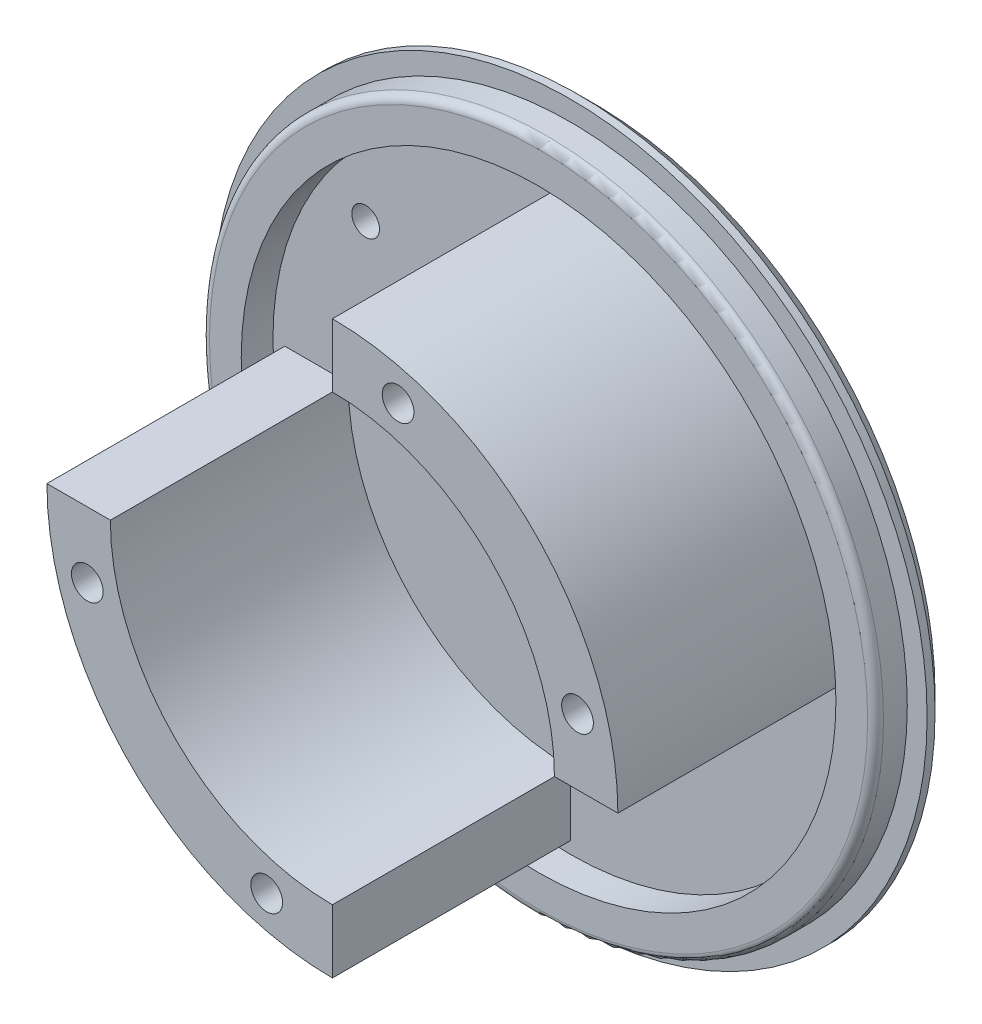
ISO-10303-21;
HEADER;
FILE_DESCRIPTION(('STEP AP214'),'2;1');
FILE_NAME('part.step','',(''),(''),'','','');
FILE_SCHEMA(('AUTOMOTIVE_DESIGN { 1 0 10303 214 1 1 1 1 }'));
ENDSEC;
DATA;
#1=APPLICATION_CONTEXT('core data for automotive mechanical design processes');
#2=APPLICATION_PROTOCOL_DEFINITION('international standard','automotive_design',2000,#1);
#3=PRODUCT_CONTEXT('',#1,'mechanical');
#4=PRODUCT('Part','Part','',(#3));
#5=PRODUCT_RELATED_PRODUCT_CATEGORY('part','',(#4));
#6=PRODUCT_DEFINITION_FORMATION('','',#4);
#7=PRODUCT_DEFINITION_CONTEXT('part definition',#1,'design');
#8=PRODUCT_DEFINITION('design','',#6,#7);
#9=PRODUCT_DEFINITION_SHAPE('','',#8);
#10=(LENGTH_UNIT() NAMED_UNIT(*) SI_UNIT(.MILLI.,.METRE.));
#11=(NAMED_UNIT(*) PLANE_ANGLE_UNIT() SI_UNIT($,.RADIAN.));
#12=(NAMED_UNIT(*) SI_UNIT($,.STERADIAN.) SOLID_ANGLE_UNIT());
#13=UNCERTAINTY_MEASURE_WITH_UNIT(LENGTH_MEASURE(1.E-05),#10,'distance_accuracy_value','');
#14=(GEOMETRIC_REPRESENTATION_CONTEXT(3) GLOBAL_UNCERTAINTY_ASSIGNED_CONTEXT((#13)) GLOBAL_UNIT_ASSIGNED_CONTEXT((#10,
#11,#12)) REPRESENTATION_CONTEXT('',''));
#15=CARTESIAN_POINT('',(0.,0.,0.));
#16=DIRECTION('',(0.,0.,1.));
#17=DIRECTION('',(1.,0.,0.));
#18=AXIS2_PLACEMENT_3D('',#15,#16,#17);
#19=CARTESIAN_POINT('',(0.,0.,3.));
#20=DIRECTION('',(0.,0.,1.));
#21=DIRECTION('',(1.,0.,0.));
#22=AXIS2_PLACEMENT_3D('',#19,#20,#21);
#23=PLANE('',#22);
#24=CARTESIAN_POINT('',(-25.809397513309,18.7383297014435,3.));
#25=DIRECTION('',(0.,0.,1.));
#26=DIRECTION('',(1.,0.,0.));
#27=AXIS2_PLACEMENT_3D('',#24,#25,#26);
#28=CIRCLE('',#27,1.75);
#29=CARTESIAN_POINT('',(-24.059397513309,18.7383297014435,3.));
#30=VERTEX_POINT('',#29);
#31=EDGE_CURVE('E322',#30,#30,#28,.T.);
#32=ORIENTED_EDGE('',*,*,#31,.F.);
#33=EDGE_LOOP('',(#32));
#34=FACE_BOUND('',#33,.T.);
#35=CARTESIAN_POINT('',(-13.7885822331377,6.71751442127217,3.));
#36=DIRECTION('',(0.,0.,1.));
#37=DIRECTION('',(1.,0.,0.));
#38=AXIS2_PLACEMENT_3D('',#35,#36,#37);
#39=CIRCLE('',#38,1.75);
#40=CARTESIAN_POINT('',(-12.0385822331377,6.71751442127217,3.));
#41=VERTEX_POINT('',#40);
#42=EDGE_CURVE('E323',#41,#41,#39,.T.);
#43=ORIENTED_EDGE('',*,*,#42,.F.);
#44=EDGE_LOOP('',(#43));
#45=FACE_BOUND('',#44,.T.);
#46=CARTESIAN_POINT('',(0.,0.,3.));
#47=DIRECTION('',(0.,0.,1.));
#48=DIRECTION('',(1.,0.,0.));
#49=AXIS2_PLACEMENT_3D('',#46,#47,#48);
#50=CIRCLE('',#49,37.5);
#51=CARTESIAN_POINT('',(37.5,0.,3.));
#52=VERTEX_POINT('',#51);
#53=EDGE_CURVE('E183',#52,#52,#50,.F.);
#54=ORIENTED_EDGE('',*,*,#53,.F.);
#55=EDGE_LOOP('',(#54));
#56=FACE_BOUND('',#55,.T.);
#57=DIRECTION('',(0.,1.,0.));
#58=VECTOR('',#57,1.);
#59=CARTESIAN_POINT('',(0.,-28.,3.));
#60=LINE('',#59,#58);
#61=CARTESIAN_POINT('',(0.,-36.,3.));
#62=VERTEX_POINT('',#61);
#63=CARTESIAN_POINT('',(0.,-28.,3.));
#64=VERTEX_POINT('',#63);
#65=EDGE_CURVE('E161',#62,#64,#60,.T.);
#66=ORIENTED_EDGE('',*,*,#65,.F.);
#67=CARTESIAN_POINT('',(0.,0.,3.));
#68=DIRECTION('',(0.,0.,1.));
#69=DIRECTION('',(1.,0.,0.));
#70=AXIS2_PLACEMENT_3D('',#67,#68,#69);
#71=CIRCLE('',#70,36.);
#72=CARTESIAN_POINT('',(-36.,0.,3.));
#73=VERTEX_POINT('',#72);
#74=EDGE_CURVE('E142',#73,#62,#71,.T.);
#75=ORIENTED_EDGE('',*,*,#74,.F.);
#76=DIRECTION('',(-1.,0.,0.));
#77=VECTOR('',#76,1.);
#78=CARTESIAN_POINT('',(-36.,0.,3.));
#79=LINE('',#78,#77);
#80=CARTESIAN_POINT('',(-28.,0.,3.));
#81=VERTEX_POINT('',#80);
#82=EDGE_CURVE('E152',#81,#73,#79,.T.);
#83=ORIENTED_EDGE('',*,*,#82,.F.);
#84=CARTESIAN_POINT('',(0.,0.,3.));
#85=DIRECTION('',(0.,0.,-1.));
#86=DIRECTION('',(1.,0.,0.));
#87=AXIS2_PLACEMENT_3D('',#84,#85,#86);
#88=CIRCLE('',#87,28.);
#89=EDGE_CURVE('E163',#64,#81,#88,.T.);
#90=ORIENTED_EDGE('',*,*,#89,.F.);
#91=EDGE_LOOP('',(#66,#75,#83,#90));
#92=FACE_BOUND('',#91,.T.);
#93=DIRECTION('',(0.,-1.,0.));
#94=VECTOR('',#93,1.);
#95=CARTESIAN_POINT('',(0.,28.,3.));
#96=LINE('',#95,#94);
#97=CARTESIAN_POINT('',(0.,36.,3.));
#98=VERTEX_POINT('',#97);
#99=CARTESIAN_POINT('',(0.,28.,3.));
#100=VERTEX_POINT('',#99);
#101=EDGE_CURVE('E348',#98,#100,#96,.T.);
#102=ORIENTED_EDGE('',*,*,#101,.F.);
#103=CARTESIAN_POINT('',(0.,0.,3.));
#104=DIRECTION('',(0.,0.,1.));
#105=DIRECTION('',(-1.,0.,0.));
#106=AXIS2_PLACEMENT_3D('',#103,#104,#105);
#107=CIRCLE('',#106,36.);
#108=CARTESIAN_POINT('',(36.,0.,3.));
#109=VERTEX_POINT('',#108);
#110=EDGE_CURVE('E129',#109,#98,#107,.T.);
#111=ORIENTED_EDGE('',*,*,#110,.F.);
#112=DIRECTION('',(1.,0.,0.));
#113=VECTOR('',#112,1.);
#114=CARTESIAN_POINT('',(36.,0.,3.));
#115=LINE('',#114,#113);
#116=CARTESIAN_POINT('',(28.,0.,3.));
#117=VERTEX_POINT('',#116);
#118=EDGE_CURVE('E125',#117,#109,#115,.T.);
#119=ORIENTED_EDGE('',*,*,#118,.F.);
#120=CARTESIAN_POINT('',(0.,0.,3.));
#121=DIRECTION('',(0.,0.,-1.));
#122=DIRECTION('',(-1.,0.,0.));
#123=AXIS2_PLACEMENT_3D('',#120,#121,#122);
#124=CIRCLE('',#123,28.);
#125=EDGE_CURVE('E350',#100,#117,#124,.T.);
#126=ORIENTED_EDGE('',*,*,#125,.F.);
#127=EDGE_LOOP('',(#102,#111,#119,#126));
#128=FACE_BOUND('',#127,.T.);
#129=ADVANCED_FACE('F40',(#34,#45,#56,#92,#128),#23,.T.);
#130=CARTESIAN_POINT('',(0.,0.,3.));
#131=DIRECTION('',(0.,0.,-1.));
#132=DIRECTION('',(-1.,0.,0.));
#133=AXIS2_PLACEMENT_3D('',#130,#131,#132);
#134=CYLINDRICAL_SURFACE('',#133,45.);
#135=CARTESIAN_POINT('',(0.,0.,2.00000000000002));
#136=DIRECTION('',(0.,0.,1.));
#137=DIRECTION('',(1.,0.,0.));
#138=AXIS2_PLACEMENT_3D('',#135,#136,#137);
#139=CIRCLE('',#138,45.);
#140=CARTESIAN_POINT('',(45.,0.,2.00000000000002));
#141=VERTEX_POINT('',#140);
#142=EDGE_CURVE('E186',#141,#141,#139,.T.);
#143=ORIENTED_EDGE('',*,*,#142,.T.);
#144=EDGE_LOOP('',(#143));
#145=FACE_BOUND('',#144,.T.);
#146=CARTESIAN_POINT('',(0.,0.,3.));
#147=DIRECTION('',(0.,0.,1.));
#148=DIRECTION('',(1.,0.,0.));
#149=AXIS2_PLACEMENT_3D('',#146,#147,#148);
#150=CIRCLE('',#149,45.);
#151=CARTESIAN_POINT('',(45.,0.,3.));
#152=VERTEX_POINT('',#151);
#153=EDGE_CURVE('E180',#152,#152,#150,.T.);
#154=ORIENTED_EDGE('',*,*,#153,.F.);
#155=EDGE_LOOP('',(#154));
#156=FACE_BOUND('',#155,.T.);
#157=ADVANCED_FACE('F212',(#145,#156),#134,.T.);
#158=CARTESIAN_POINT('',(0.,0.,3.));
#159=DIRECTION('',(0.,0.,1.));
#160=DIRECTION('',(1.,0.,0.));
#161=AXIS2_PLACEMENT_3D('',#158,#159,#160);
#162=CIRCLE('',#161,42.5);
#163=CARTESIAN_POINT('',(42.5,0.,3.));
#164=VERTEX_POINT('',#163);
#165=EDGE_CURVE('E177',#164,#164,#162,.T.);
#166=ORIENTED_EDGE('',*,*,#165,.F.);
#167=EDGE_LOOP('',(#166));
#168=FACE_BOUND('',#167,.T.);
#169=ORIENTED_EDGE('',*,*,#153,.T.);
#170=EDGE_LOOP('',(#169));
#171=FACE_BOUND('',#170,.T.);
#172=ADVANCED_FACE('F215',(#168,#171),#23,.T.);
#173=CARTESIAN_POINT('',(0.,0.,0.));
#174=DIRECTION('',(0.,0.,1.));
#175=DIRECTION('',(1.,0.,0.));
#176=AXIS2_PLACEMENT_3D('',#173,#174,#175);
#177=PLANE('',#176);
#178=CARTESIAN_POINT('',(-25.809397513309,18.7383297014435,0.));
#179=DIRECTION('',(0.,0.,1.));
#180=DIRECTION('',(1.,0.,0.));
#181=AXIS2_PLACEMENT_3D('',#178,#179,#180);
#182=CIRCLE('',#181,1.75);
#183=CARTESIAN_POINT('',(-24.059397513309,18.7383297014435,0.));
#184=VERTEX_POINT('',#183);
#185=EDGE_CURVE('E320',#184,#184,#182,.T.);
#186=ORIENTED_EDGE('',*,*,#185,.T.);
#187=EDGE_LOOP('',(#186));
#188=FACE_BOUND('',#187,.T.);
#189=CARTESIAN_POINT('',(-13.7885822331377,6.71751442127217,0.));
#190=DIRECTION('',(0.,0.,1.));
#191=DIRECTION('',(1.,0.,0.));
#192=AXIS2_PLACEMENT_3D('',#189,#190,#191);
#193=CIRCLE('',#192,1.75);
#194=CARTESIAN_POINT('',(-12.0385822331377,6.71751442127217,0.));
#195=VERTEX_POINT('',#194);
#196=EDGE_CURVE('E328',#195,#195,#193,.T.);
#197=ORIENTED_EDGE('',*,*,#196,.T.);
#198=EDGE_LOOP('',(#197));
#199=FACE_BOUND('',#198,.T.);
#200=CARTESIAN_POINT('',(0.,0.,0.));
#201=DIRECTION('',(0.,0.,1.));
#202=DIRECTION('',(1.,0.,0.));
#203=AXIS2_PLACEMENT_3D('',#200,#201,#202);
#204=CIRCLE('',#203,43.);
#205=CARTESIAN_POINT('',(43.,0.,0.));
#206=VERTEX_POINT('',#205);
#207=EDGE_CURVE('E189',#206,#206,#204,.F.);
#208=ORIENTED_EDGE('',*,*,#207,.T.);
#209=EDGE_LOOP('',(#208));
#210=FACE_BOUND('',#209,.T.);
#211=ADVANCED_FACE('F226',(#188,#199,#210),#177,.F.);
#212=CARTESIAN_POINT('',(0.,0.,7.));
#213=DIRECTION('',(0.,0.,1.));
#214=DIRECTION('',(1.,0.,0.));
#215=AXIS2_PLACEMENT_3D('',#212,#213,#214);
#216=PLANE('',#215);
#217=CARTESIAN_POINT('',(0.,0.,7.));
#218=DIRECTION('',(0.,0.,1.));
#219=DIRECTION('',(1.,0.,0.));
#220=AXIS2_PLACEMENT_3D('',#217,#218,#219);
#221=CIRCLE('',#220,41.5);
#222=CARTESIAN_POINT('',(41.5,0.,7.));
#223=VERTEX_POINT('',#222);
#224=EDGE_CURVE('E48',#223,#223,#221,.T.);
#225=ORIENTED_EDGE('',*,*,#224,.T.);
#226=EDGE_LOOP('',(#225));
#227=FACE_BOUND('',#226,.T.);
#228=CARTESIAN_POINT('',(0.,0.,7.));
#229=DIRECTION('',(0.,0.,1.));
#230=DIRECTION('',(1.,0.,0.));
#231=AXIS2_PLACEMENT_3D('',#228,#229,#230);
#232=CIRCLE('',#231,37.5);
#233=CARTESIAN_POINT('',(37.5,0.,7.));
#234=VERTEX_POINT('',#233);
#235=EDGE_CURVE('E174',#234,#234,#232,.T.);
#236=ORIENTED_EDGE('',*,*,#235,.F.);
#237=EDGE_LOOP('',(#236));
#238=FACE_BOUND('',#237,.T.);
#239=ADVANCED_FACE('F194',(#227,#238),#216,.T.);
#240=CARTESIAN_POINT('',(0.,0.,7.));
#241=DIRECTION('',(0.,0.,-1.));
#242=DIRECTION('',(-1.,0.,0.));
#243=AXIS2_PLACEMENT_3D('',#240,#241,#242);
#244=CYLINDRICAL_SURFACE('',#243,42.5);
#245=CARTESIAN_POINT('',(0.,0.,6.));
#246=DIRECTION('',(0.,0.,1.));
#247=DIRECTION('',(1.,0.,0.));
#248=AXIS2_PLACEMENT_3D('',#245,#246,#247);
#249=CIRCLE('',#248,42.5);
#250=CARTESIAN_POINT('',(42.5,0.,6.));
#251=VERTEX_POINT('',#250);
#252=EDGE_CURVE('E11',#251,#251,#249,.F.);
#253=ORIENTED_EDGE('',*,*,#252,.T.);
#254=EDGE_LOOP('',(#253));
#255=FACE_BOUND('',#254,.T.);
#256=ORIENTED_EDGE('',*,*,#165,.T.);
#257=EDGE_LOOP('',(#256));
#258=FACE_BOUND('',#257,.T.);
#259=ADVANCED_FACE('F237',(#255,#258),#244,.T.);
#260=CARTESIAN_POINT('',(0.,0.,7.));
#261=DIRECTION('',(0.,0.,-1.));
#262=DIRECTION('',(-1.,0.,0.));
#263=AXIS2_PLACEMENT_3D('',#260,#261,#262);
#264=CYLINDRICAL_SURFACE('',#263,37.5);
#265=ORIENTED_EDGE('',*,*,#235,.T.);
#266=EDGE_LOOP('',(#265));
#267=FACE_BOUND('',#266,.T.);
#268=ORIENTED_EDGE('',*,*,#53,.T.);
#269=EDGE_LOOP('',(#268));
#270=FACE_BOUND('',#269,.T.);
#271=ADVANCED_FACE('F208',(#267,#270),#264,.F.);
#272=CARTESIAN_POINT('',(0.,0.,2.00000000000002));
#273=DIRECTION('',(0.,0.,1.));
#274=DIRECTION('',(1.,0.,0.));
#275=AXIS2_PLACEMENT_3D('',#272,#273,#274);
#276=CONICAL_SURFACE('',#275,45.,0.785398163397453);
#277=ORIENTED_EDGE('',*,*,#207,.F.);
#278=EDGE_LOOP('',(#277));
#279=FACE_BOUND('',#278,.T.);
#280=ORIENTED_EDGE('',*,*,#142,.F.);
#281=EDGE_LOOP('',(#280));
#282=FACE_BOUND('',#281,.T.);
#283=ADVANCED_FACE('F199',(#279,#282),#276,.T.);
#284=CARTESIAN_POINT('',(0.,0.,6.));
#285=DIRECTION('',(0.,0.,1.));
#286=DIRECTION('',(1.,0.,0.));
#287=AXIS2_PLACEMENT_3D('',#284,#285,#286);
#288=TOROIDAL_SURFACE('',#287,41.5,1.);
#289=ORIENTED_EDGE('',*,*,#252,.F.);
#290=EDGE_LOOP('',(#289));
#291=FACE_BOUND('',#290,.T.);
#292=ORIENTED_EDGE('',*,*,#224,.F.);
#293=EDGE_LOOP('',(#292));
#294=FACE_BOUND('',#293,.T.);
#295=ADVANCED_FACE('F42',(#291,#294),#288,.T.);
#296=CARTESIAN_POINT('',(0.,0.,33.));
#297=DIRECTION('',(0.,0.,-1.));
#298=DIRECTION('',(-1.,0.,0.));
#299=AXIS2_PLACEMENT_3D('',#296,#297,#298);
#300=CYLINDRICAL_SURFACE('',#299,36.);
#301=ORIENTED_EDGE('',*,*,#74,.T.);
#302=DIRECTION('',(0.,0.,-1.));
#303=VECTOR('',#302,1.);
#304=CARTESIAN_POINT('',(0.,-36.,33.));
#305=LINE('',#304,#303);
#306=CARTESIAN_POINT('',(0.,-36.,33.));
#307=VERTEX_POINT('',#306);
#308=EDGE_CURVE('E172',#307,#62,#305,.T.);
#309=ORIENTED_EDGE('',*,*,#308,.F.);
#310=CARTESIAN_POINT('',(0.,0.,33.));
#311=DIRECTION('',(0.,0.,1.));
#312=DIRECTION('',(1.,0.,0.));
#313=AXIS2_PLACEMENT_3D('',#310,#311,#312);
#314=CIRCLE('',#313,36.);
#315=CARTESIAN_POINT('',(-36.,0.,33.));
#316=VERTEX_POINT('',#315);
#317=EDGE_CURVE('E148',#316,#307,#314,.T.);
#318=ORIENTED_EDGE('',*,*,#317,.F.);
#319=DIRECTION('',(0.,0.,-1.));
#320=VECTOR('',#319,1.);
#321=CARTESIAN_POINT('',(-36.,0.,33.));
#322=LINE('',#321,#320);
#323=EDGE_CURVE('E158',#316,#73,#322,.T.);
#324=ORIENTED_EDGE('',*,*,#323,.T.);
#325=EDGE_LOOP('',(#301,#309,#318,#324));
#326=FACE_BOUND('',#325,.T.);
#327=ADVANCED_FACE('F198',(#326),#300,.T.);
#328=CARTESIAN_POINT('',(0.,-28.,33.));
#329=DIRECTION('',(-1.,0.,0.));
#330=DIRECTION('',(0.,0.,1.));
#331=AXIS2_PLACEMENT_3D('',#328,#329,#330);
#332=PLANE('',#331);
#333=ORIENTED_EDGE('',*,*,#65,.T.);
#334=DIRECTION('',(0.,0.,-1.));
#335=VECTOR('',#334,1.);
#336=CARTESIAN_POINT('',(0.,-28.,33.));
#337=LINE('',#336,#335);
#338=CARTESIAN_POINT('',(0.,-28.,33.));
#339=VERTEX_POINT('',#338);
#340=EDGE_CURVE('E169',#339,#64,#337,.T.);
#341=ORIENTED_EDGE('',*,*,#340,.F.);
#342=DIRECTION('',(0.,1.,0.));
#343=VECTOR('',#342,1.);
#344=CARTESIAN_POINT('',(0.,-28.,33.));
#345=LINE('',#344,#343);
#346=EDGE_CURVE('E151',#307,#339,#345,.T.);
#347=ORIENTED_EDGE('',*,*,#346,.F.);
#348=ORIENTED_EDGE('',*,*,#308,.T.);
#349=EDGE_LOOP('',(#333,#341,#347,#348));
#350=FACE_BOUND('',#349,.T.);
#351=ADVANCED_FACE('F205',(#350),#332,.F.);
#352=CARTESIAN_POINT('',(0.,0.,33.));
#353=DIRECTION('',(0.,0.,-1.));
#354=DIRECTION('',(-1.,0.,0.));
#355=AXIS2_PLACEMENT_3D('',#352,#353,#354);
#356=CYLINDRICAL_SURFACE('',#355,28.);
#357=ORIENTED_EDGE('',*,*,#89,.T.);
#358=DIRECTION('',(0.,0.,-1.));
#359=VECTOR('',#358,1.);
#360=CARTESIAN_POINT('',(-28.,0.,33.));
#361=LINE('',#360,#359);
#362=CARTESIAN_POINT('',(-28.,0.,33.));
#363=VERTEX_POINT('',#362);
#364=EDGE_CURVE('E63',#363,#81,#361,.T.);
#365=ORIENTED_EDGE('',*,*,#364,.F.);
#366=CARTESIAN_POINT('',(0.,0.,33.));
#367=DIRECTION('',(0.,0.,-1.));
#368=DIRECTION('',(1.,0.,0.));
#369=AXIS2_PLACEMENT_3D('',#366,#367,#368);
#370=CIRCLE('',#369,28.);
#371=EDGE_CURVE('E154',#339,#363,#370,.T.);
#372=ORIENTED_EDGE('',*,*,#371,.F.);
#373=ORIENTED_EDGE('',*,*,#340,.T.);
#374=EDGE_LOOP('',(#357,#365,#372,#373));
#375=FACE_BOUND('',#374,.T.);
#376=ADVANCED_FACE('F250',(#375),#356,.F.);
#377=CARTESIAN_POINT('',(-36.,0.,33.));
#378=DIRECTION('',(0.,-1.,0.));
#379=DIRECTION('',(0.,0.,-1.));
#380=AXIS2_PLACEMENT_3D('',#377,#378,#379);
#381=PLANE('',#380);
#382=ORIENTED_EDGE('',*,*,#82,.T.);
#383=ORIENTED_EDGE('',*,*,#323,.F.);
#384=DIRECTION('',(-1.,0.,0.));
#385=VECTOR('',#384,1.);
#386=CARTESIAN_POINT('',(-36.,0.,33.));
#387=LINE('',#386,#385);
#388=EDGE_CURVE('E156',#363,#316,#387,.T.);
#389=ORIENTED_EDGE('',*,*,#388,.F.);
#390=ORIENTED_EDGE('',*,*,#364,.T.);
#391=EDGE_LOOP('',(#382,#383,#389,#390));
#392=FACE_BOUND('',#391,.T.);
#393=ADVANCED_FACE('F254',(#392),#381,.F.);
#394=CARTESIAN_POINT('',(0.,0.,33.));
#395=DIRECTION('',(0.,0.,1.));
#396=DIRECTION('',(1.,0.,0.));
#397=AXIS2_PLACEMENT_3D('',#394,#395,#396);
#398=PLANE('',#397);
#399=CARTESIAN_POINT('',(-30.9096264412502,-8.28220944328069,33.));
#400=DIRECTION('',(0.,0.,1.));
#401=DIRECTION('',(1.,0.,0.));
#402=AXIS2_PLACEMENT_3D('',#399,#400,#401);
#403=CIRCLE('',#402,2.);
#404=CARTESIAN_POINT('',(-28.9096264412502,-8.28220944328069,33.));
#405=VERTEX_POINT('',#404);
#406=EDGE_CURVE('E143',#405,#405,#403,.T.);
#407=ORIENTED_EDGE('',*,*,#406,.F.);
#408=EDGE_LOOP('',(#407));
#409=FACE_BOUND('',#408,.T.);
#410=CARTESIAN_POINT('',(-8.28220944328068,-30.9096264412502,33.));
#411=DIRECTION('',(0.,0.,1.));
#412=DIRECTION('',(1.,0.,0.));
#413=AXIS2_PLACEMENT_3D('',#410,#411,#412);
#414=CIRCLE('',#413,2.);
#415=CARTESIAN_POINT('',(-6.28220944328068,-30.9096264412502,33.));
#416=VERTEX_POINT('',#415);
#417=EDGE_CURVE('E134',#416,#416,#414,.T.);
#418=ORIENTED_EDGE('',*,*,#417,.F.);
#419=EDGE_LOOP('',(#418));
#420=FACE_BOUND('',#419,.T.);
#421=ORIENTED_EDGE('',*,*,#317,.T.);
#422=ORIENTED_EDGE('',*,*,#346,.T.);
#423=ORIENTED_EDGE('',*,*,#371,.T.);
#424=ORIENTED_EDGE('',*,*,#388,.T.);
#425=EDGE_LOOP('',(#421,#422,#423,#424));
#426=FACE_BOUND('',#425,.T.);
#427=ADVANCED_FACE('F258',(#409,#420,#426),#398,.T.);
#428=CARTESIAN_POINT('',(-8.28220944328068,-30.9096264412502,18.));
#429=DIRECTION('',(0.,0.,1.));
#430=DIRECTION('',(1.,0.,0.));
#431=AXIS2_PLACEMENT_3D('',#428,#429,#430);
#432=CYLINDRICAL_SURFACE('',#431,2.);
#433=CARTESIAN_POINT('',(-8.28220944328068,-30.9096264412502,18.));
#434=DIRECTION('',(0.,0.,1.));
#435=DIRECTION('',(1.,0.,0.));
#436=AXIS2_PLACEMENT_3D('',#433,#434,#435);
#437=CIRCLE('',#436,2.);
#438=CARTESIAN_POINT('',(-6.28220944328068,-30.9096264412502,18.));
#439=VERTEX_POINT('',#438);
#440=EDGE_CURVE('E131',#439,#439,#437,.T.);
#441=ORIENTED_EDGE('',*,*,#440,.F.);
#442=EDGE_LOOP('',(#441));
#443=FACE_BOUND('',#442,.T.);
#444=ORIENTED_EDGE('',*,*,#417,.T.);
#445=EDGE_LOOP('',(#444));
#446=FACE_BOUND('',#445,.T.);
#447=ADVANCED_FACE('F261',(#443,#446),#432,.F.);
#448=CARTESIAN_POINT('',(-8.28220944328068,-30.9096264412502,18.));
#449=DIRECTION('',(0.,0.,1.));
#450=DIRECTION('',(1.,0.,0.));
#451=AXIS2_PLACEMENT_3D('',#448,#449,#450);
#452=PLANE('',#451);
#453=ORIENTED_EDGE('',*,*,#440,.T.);
#454=EDGE_LOOP('',(#453));
#455=FACE_BOUND('',#454,.T.);
#456=ADVANCED_FACE('F263',(#455),#452,.T.);
#457=CARTESIAN_POINT('',(-30.9096264412502,-8.28220944328069,18.));
#458=DIRECTION('',(0.,0.,1.));
#459=DIRECTION('',(1.,0.,0.));
#460=AXIS2_PLACEMENT_3D('',#457,#458,#459);
#461=CYLINDRICAL_SURFACE('',#460,2.);
#462=CARTESIAN_POINT('',(-30.9096264412502,-8.28220944328069,18.));
#463=DIRECTION('',(0.,0.,1.));
#464=DIRECTION('',(1.,0.,0.));
#465=AXIS2_PLACEMENT_3D('',#462,#463,#464);
#466=CIRCLE('',#465,2.);
#467=CARTESIAN_POINT('',(-28.9096264412502,-8.28220944328069,18.));
#468=VERTEX_POINT('',#467);
#469=EDGE_CURVE('E139',#468,#468,#466,.T.);
#470=ORIENTED_EDGE('',*,*,#469,.F.);
#471=EDGE_LOOP('',(#470));
#472=FACE_BOUND('',#471,.T.);
#473=ORIENTED_EDGE('',*,*,#406,.T.);
#474=EDGE_LOOP('',(#473));
#475=FACE_BOUND('',#474,.T.);
#476=ADVANCED_FACE('F266',(#472,#475),#461,.F.);
#477=CARTESIAN_POINT('',(-30.9096264412502,-8.28220944328069,18.));
#478=DIRECTION('',(0.,0.,1.));
#479=DIRECTION('',(1.,0.,0.));
#480=AXIS2_PLACEMENT_3D('',#477,#478,#479);
#481=PLANE('',#480);
#482=ORIENTED_EDGE('',*,*,#469,.T.);
#483=EDGE_LOOP('',(#482));
#484=FACE_BOUND('',#483,.T.);
#485=ADVANCED_FACE('F273',(#484),#481,.T.);
#486=CARTESIAN_POINT('',(0.,0.,33.));
#487=DIRECTION('',(0.,0.,-1.));
#488=DIRECTION('',(-1.,0.,0.));
#489=AXIS2_PLACEMENT_3D('',#486,#487,#488);
#490=CYLINDRICAL_SURFACE('',#489,36.);
#491=ORIENTED_EDGE('',*,*,#110,.T.);
#492=DIRECTION('',(0.,0.,-1.));
#493=VECTOR('',#492,1.);
#494=CARTESIAN_POINT('',(0.,36.,33.));
#495=LINE('',#494,#493);
#496=CARTESIAN_POINT('',(0.,36.,33.));
#497=VERTEX_POINT('',#496);
#498=EDGE_CURVE('E110',#497,#98,#495,.T.);
#499=ORIENTED_EDGE('',*,*,#498,.F.);
#500=CARTESIAN_POINT('',(0.,0.,33.));
#501=DIRECTION('',(0.,0.,1.));
#502=DIRECTION('',(-1.,0.,0.));
#503=AXIS2_PLACEMENT_3D('',#500,#501,#502);
#504=CIRCLE('',#503,36.);
#505=CARTESIAN_POINT('',(36.,0.,33.));
#506=VERTEX_POINT('',#505);
#507=EDGE_CURVE('E117',#506,#497,#504,.T.);
#508=ORIENTED_EDGE('',*,*,#507,.F.);
#509=DIRECTION('',(0.,0.,-1.));
#510=VECTOR('',#509,1.);
#511=CARTESIAN_POINT('',(36.,0.,33.));
#512=LINE('',#511,#510);
#513=EDGE_CURVE('E346',#506,#109,#512,.T.);
#514=ORIENTED_EDGE('',*,*,#513,.T.);
#515=EDGE_LOOP('',(#491,#499,#508,#514));
#516=FACE_BOUND('',#515,.T.);
#517=ADVANCED_FACE('F127',(#516),#490,.T.);
#518=CARTESIAN_POINT('',(0.,28.,33.));
#519=DIRECTION('',(1.,0.,0.));
#520=DIRECTION('',(0.,0.,-1.));
#521=AXIS2_PLACEMENT_3D('',#518,#519,#520);
#522=PLANE('',#521);
#523=ORIENTED_EDGE('',*,*,#101,.T.);
#524=DIRECTION('',(0.,0.,-1.));
#525=VECTOR('',#524,1.);
#526=CARTESIAN_POINT('',(0.,28.,33.));
#527=LINE('',#526,#525);
#528=CARTESIAN_POINT('',(0.,28.,33.));
#529=VERTEX_POINT('',#528);
#530=EDGE_CURVE('E113',#529,#100,#527,.T.);
#531=ORIENTED_EDGE('',*,*,#530,.F.);
#532=DIRECTION('',(0.,-1.,0.));
#533=VECTOR('',#532,1.);
#534=CARTESIAN_POINT('',(0.,28.,33.));
#535=LINE('',#534,#533);
#536=EDGE_CURVE('E106',#497,#529,#535,.T.);
#537=ORIENTED_EDGE('',*,*,#536,.F.);
#538=ORIENTED_EDGE('',*,*,#498,.T.);
#539=EDGE_LOOP('',(#523,#531,#537,#538));
#540=FACE_BOUND('',#539,.T.);
#541=ADVANCED_FACE('F108',(#540),#522,.F.);
#542=CARTESIAN_POINT('',(0.,0.,33.));
#543=DIRECTION('',(0.,0.,-1.));
#544=DIRECTION('',(-1.,0.,0.));
#545=AXIS2_PLACEMENT_3D('',#542,#543,#544);
#546=CYLINDRICAL_SURFACE('',#545,28.);
#547=ORIENTED_EDGE('',*,*,#125,.T.);
#548=DIRECTION('',(0.,0.,-1.));
#549=VECTOR('',#548,1.);
#550=CARTESIAN_POINT('',(28.,0.,33.));
#551=LINE('',#550,#549);
#552=CARTESIAN_POINT('',(28.,0.,33.));
#553=VERTEX_POINT('',#552);
#554=EDGE_CURVE('E55',#553,#117,#551,.T.);
#555=ORIENTED_EDGE('',*,*,#554,.F.);
#556=CARTESIAN_POINT('',(0.,0.,33.));
#557=DIRECTION('',(0.,0.,-1.));
#558=DIRECTION('',(-1.,0.,0.));
#559=AXIS2_PLACEMENT_3D('',#556,#557,#558);
#560=CIRCLE('',#559,28.);
#561=EDGE_CURVE('E116',#529,#553,#560,.T.);
#562=ORIENTED_EDGE('',*,*,#561,.F.);
#563=ORIENTED_EDGE('',*,*,#530,.T.);
#564=EDGE_LOOP('',(#547,#555,#562,#563));
#565=FACE_BOUND('',#564,.T.);
#566=ADVANCED_FACE('F282',(#565),#546,.F.);
#567=CARTESIAN_POINT('',(36.,0.,33.));
#568=DIRECTION('',(0.,1.,0.));
#569=DIRECTION('',(0.,0.,1.));
#570=AXIS2_PLACEMENT_3D('',#567,#568,#569);
#571=PLANE('',#570);
#572=ORIENTED_EDGE('',*,*,#118,.T.);
#573=ORIENTED_EDGE('',*,*,#513,.F.);
#574=DIRECTION('',(1.,0.,0.));
#575=VECTOR('',#574,1.);
#576=CARTESIAN_POINT('',(36.,0.,33.));
#577=LINE('',#576,#575);
#578=EDGE_CURVE('E121',#553,#506,#577,.T.);
#579=ORIENTED_EDGE('',*,*,#578,.F.);
#580=ORIENTED_EDGE('',*,*,#554,.T.);
#581=EDGE_LOOP('',(#572,#573,#579,#580));
#582=FACE_BOUND('',#581,.T.);
#583=ADVANCED_FACE('F285',(#582),#571,.F.);
#584=CARTESIAN_POINT('',(0.,0.,33.));
#585=DIRECTION('',(0.,0.,1.));
#586=DIRECTION('',(-1.,0.,0.));
#587=AXIS2_PLACEMENT_3D('',#584,#585,#586);
#588=PLANE('',#587);
#589=CARTESIAN_POINT('',(30.9096264412502,8.28220944328069,33.));
#590=DIRECTION('',(0.,0.,1.));
#591=DIRECTION('',(-1.,0.,0.));
#592=AXIS2_PLACEMENT_3D('',#589,#590,#591);
#593=CIRCLE('',#592,2.);
#594=CARTESIAN_POINT('',(28.9096264412502,8.28220944328069,33.));
#595=VERTEX_POINT('',#594);
#596=EDGE_CURVE('E336',#595,#595,#593,.T.);
#597=ORIENTED_EDGE('',*,*,#596,.F.);
#598=EDGE_LOOP('',(#597));
#599=FACE_BOUND('',#598,.T.);
#600=CARTESIAN_POINT('',(8.28220944328068,30.9096264412502,33.));
#601=DIRECTION('',(0.,0.,1.));
#602=DIRECTION('',(-1.,0.,0.));
#603=AXIS2_PLACEMENT_3D('',#600,#601,#602);
#604=CIRCLE('',#603,2.);
#605=CARTESIAN_POINT('',(6.28220944328068,30.9096264412502,33.));
#606=VERTEX_POINT('',#605);
#607=EDGE_CURVE('E325',#606,#606,#604,.T.);
#608=ORIENTED_EDGE('',*,*,#607,.F.);
#609=EDGE_LOOP('',(#608));
#610=FACE_BOUND('',#609,.T.);
#611=ORIENTED_EDGE('',*,*,#507,.T.);
#612=ORIENTED_EDGE('',*,*,#536,.T.);
#613=ORIENTED_EDGE('',*,*,#561,.T.);
#614=ORIENTED_EDGE('',*,*,#578,.T.);
#615=EDGE_LOOP('',(#611,#612,#613,#614));
#616=FACE_BOUND('',#615,.T.);
#617=ADVANCED_FACE('F120',(#599,#610,#616),#588,.T.);
#618=CARTESIAN_POINT('',(8.28220944328068,30.9096264412502,18.));
#619=DIRECTION('',(0.,0.,1.));
#620=DIRECTION('',(1.,0.,0.));
#621=AXIS2_PLACEMENT_3D('',#618,#619,#620);
#622=CYLINDRICAL_SURFACE('',#621,2.);
#623=CARTESIAN_POINT('',(8.28220944328068,30.9096264412502,18.));
#624=DIRECTION('',(0.,0.,1.));
#625=DIRECTION('',(-1.,0.,0.));
#626=AXIS2_PLACEMENT_3D('',#623,#624,#625);
#627=CIRCLE('',#626,2.);
#628=CARTESIAN_POINT('',(6.28220944328068,30.9096264412502,18.));
#629=VERTEX_POINT('',#628);
#630=EDGE_CURVE('E339',#629,#629,#627,.T.);
#631=ORIENTED_EDGE('',*,*,#630,.F.);
#632=EDGE_LOOP('',(#631));
#633=FACE_BOUND('',#632,.T.);
#634=ORIENTED_EDGE('',*,*,#607,.T.);
#635=EDGE_LOOP('',(#634));
#636=FACE_BOUND('',#635,.T.);
#637=ADVANCED_FACE('F291',(#633,#636),#622,.F.);
#638=CARTESIAN_POINT('',(8.28220944328068,30.9096264412502,18.));
#639=DIRECTION('',(0.,0.,1.));
#640=DIRECTION('',(-1.,0.,0.));
#641=AXIS2_PLACEMENT_3D('',#638,#639,#640);
#642=PLANE('',#641);
#643=ORIENTED_EDGE('',*,*,#630,.T.);
#644=EDGE_LOOP('',(#643));
#645=FACE_BOUND('',#644,.T.);
#646=ADVANCED_FACE('F295',(#645),#642,.T.);
#647=CARTESIAN_POINT('',(30.9096264412502,8.28220944328069,18.));
#648=DIRECTION('',(0.,0.,1.));
#649=DIRECTION('',(1.,0.,0.));
#650=AXIS2_PLACEMENT_3D('',#647,#648,#649);
#651=CYLINDRICAL_SURFACE('',#650,2.);
#652=CARTESIAN_POINT('',(30.9096264412502,8.28220944328069,18.));
#653=DIRECTION('',(0.,0.,1.));
#654=DIRECTION('',(-1.,0.,0.));
#655=AXIS2_PLACEMENT_3D('',#652,#653,#654);
#656=CIRCLE('',#655,2.);
#657=CARTESIAN_POINT('',(28.9096264412502,8.28220944328069,18.));
#658=VERTEX_POINT('',#657);
#659=EDGE_CURVE('E333',#658,#658,#656,.T.);
#660=ORIENTED_EDGE('',*,*,#659,.F.);
#661=EDGE_LOOP('',(#660));
#662=FACE_BOUND('',#661,.T.);
#663=ORIENTED_EDGE('',*,*,#596,.T.);
#664=EDGE_LOOP('',(#663));
#665=FACE_BOUND('',#664,.T.);
#666=ADVANCED_FACE('F299',(#662,#665),#651,.F.);
#667=CARTESIAN_POINT('',(30.9096264412502,8.28220944328069,18.));
#668=DIRECTION('',(0.,0.,1.));
#669=DIRECTION('',(-1.,0.,0.));
#670=AXIS2_PLACEMENT_3D('',#667,#668,#669);
#671=PLANE('',#670);
#672=ORIENTED_EDGE('',*,*,#659,.T.);
#673=EDGE_LOOP('',(#672));
#674=FACE_BOUND('',#673,.T.);
#675=ADVANCED_FACE('F303',(#674),#671,.T.);
#676=CARTESIAN_POINT('',(-13.7885822331377,6.71751442127217,0.));
#677=DIRECTION('',(0.,0.,1.));
#678=DIRECTION('',(1.,0.,0.));
#679=AXIS2_PLACEMENT_3D('',#676,#677,#678);
#680=CYLINDRICAL_SURFACE('',#679,1.75);
#681=ORIENTED_EDGE('',*,*,#196,.F.);
#682=EDGE_LOOP('',(#681));
#683=FACE_BOUND('',#682,.T.);
#684=ORIENTED_EDGE('',*,*,#42,.T.);
#685=EDGE_LOOP('',(#684));
#686=FACE_BOUND('',#685,.T.);
#687=ADVANCED_FACE('F307',(#683,#686),#680,.F.);
#688=CARTESIAN_POINT('',(-25.809397513309,18.7383297014435,0.));
#689=DIRECTION('',(0.,0.,1.));
#690=DIRECTION('',(1.,0.,0.));
#691=AXIS2_PLACEMENT_3D('',#688,#689,#690);
#692=CYLINDRICAL_SURFACE('',#691,1.75);
#693=ORIENTED_EDGE('',*,*,#185,.F.);
#694=EDGE_LOOP('',(#693));
#695=FACE_BOUND('',#694,.T.);
#696=ORIENTED_EDGE('',*,*,#31,.T.);
#697=EDGE_LOOP('',(#696));
#698=FACE_BOUND('',#697,.T.);
#699=ADVANCED_FACE('F311',(#695,#698),#692,.F.);
#700=CLOSED_SHELL('',(#129,#157,#172,#211,#239,#259,#271,#283,#295,#327,#351,#376,#393,#427,
#447,#456,#476,#485,#517,#541,#566,#583,#617,#637,#646,#666,#675,#687,#699));
#701=MANIFOLD_SOLID_BREP('B2',#700);
#702=ADVANCED_BREP_SHAPE_REPRESENTATION('',(#18,#701),#14);
#703=SHAPE_DEFINITION_REPRESENTATION(#9,#702);
ENDSEC;
END-ISO-10303-21;
